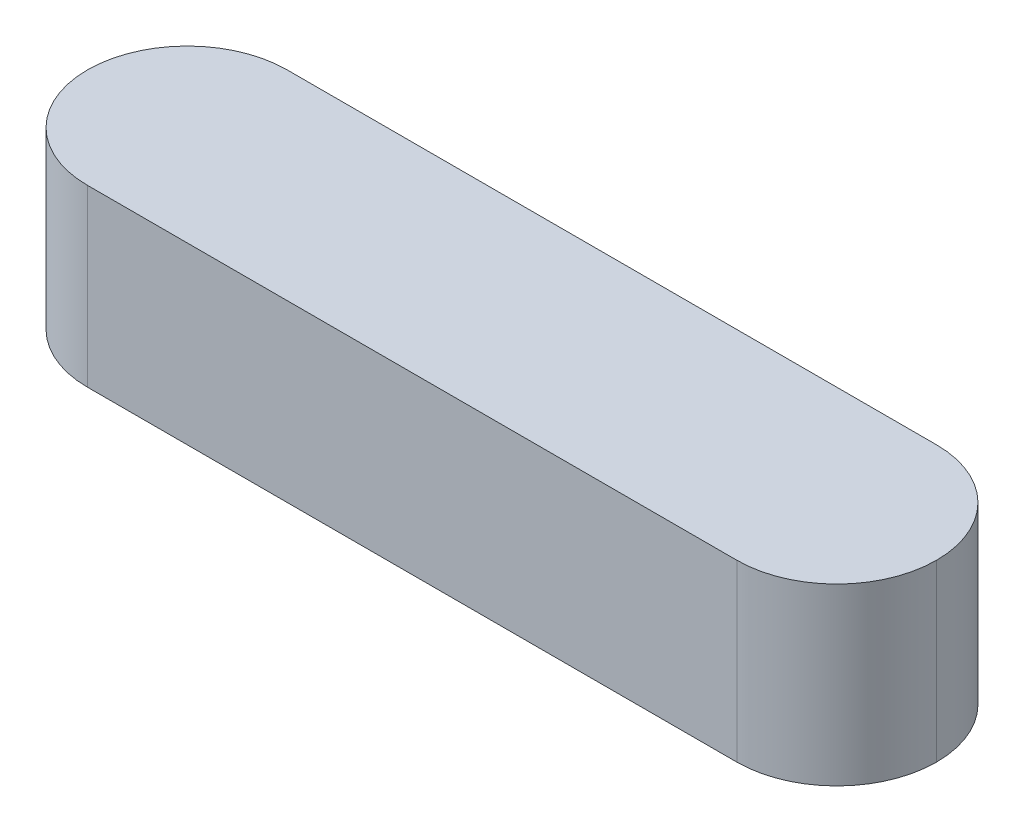
ISO-10303-21;
HEADER;
FILE_DESCRIPTION(('STEP AP214'),'2;1');
FILE_NAME('part.step','',(''),(''),'','','');
FILE_SCHEMA(('AUTOMOTIVE_DESIGN { 1 0 10303 214 1 1 1 1 }'));
ENDSEC;
DATA;
#1=APPLICATION_CONTEXT('core data for automotive mechanical design processes');
#2=APPLICATION_PROTOCOL_DEFINITION('international standard','automotive_design',2000,#1);
#3=PRODUCT_CONTEXT('',#1,'mechanical');
#4=PRODUCT('Part','Part','',(#3));
#5=PRODUCT_RELATED_PRODUCT_CATEGORY('part','',(#4));
#6=PRODUCT_DEFINITION_FORMATION('','',#4);
#7=PRODUCT_DEFINITION_CONTEXT('part definition',#1,'design');
#8=PRODUCT_DEFINITION('design','',#6,#7);
#9=PRODUCT_DEFINITION_SHAPE('','',#8);
#10=(LENGTH_UNIT() NAMED_UNIT(*) SI_UNIT(.MILLI.,.METRE.));
#11=(NAMED_UNIT(*) PLANE_ANGLE_UNIT() SI_UNIT($,.RADIAN.));
#12=(NAMED_UNIT(*) SI_UNIT($,.STERADIAN.) SOLID_ANGLE_UNIT());
#13=UNCERTAINTY_MEASURE_WITH_UNIT(LENGTH_MEASURE(1.E-05),#10,'distance_accuracy_value','');
#14=(GEOMETRIC_REPRESENTATION_CONTEXT(3) GLOBAL_UNCERTAINTY_ASSIGNED_CONTEXT((#13)) GLOBAL_UNIT_ASSIGNED_CONTEXT((#10,
#11,#12)) REPRESENTATION_CONTEXT('',''));
#15=CARTESIAN_POINT('',(0.,0.,0.));
#16=DIRECTION('',(0.,0.,1.));
#17=DIRECTION('',(1.,0.,0.));
#18=AXIS2_PLACEMENT_3D('',#15,#16,#17);
#19=CARTESIAN_POINT('',(-9.90979350945183,7.,0.));
#20=DIRECTION('',(0.,0.,-1.));
#21=DIRECTION('',(-1.,0.,0.));
#22=AXIS2_PLACEMENT_3D('',#19,#20,#21);
#23=PLANE('',#22);
#24=DIRECTION('',(1.,0.,0.));
#25=VECTOR('',#24,1.);
#26=CARTESIAN_POINT('',(-9.90979350945183,0.,0.));
#27=LINE('',#26,#25);
#28=CARTESIAN_POINT('',(-5.90979350945183,0.,0.));
#29=VERTEX_POINT('',#28);
#30=CARTESIAN_POINT('',(20.0902064905482,0.,0.));
#31=VERTEX_POINT('',#30);
#32=EDGE_CURVE('E132',#29,#31,#27,.T.);
#33=ORIENTED_EDGE('',*,*,#32,.T.);
#34=DIRECTION('',(0.,-1.,0.));
#35=VECTOR('',#34,1.);
#36=CARTESIAN_POINT('',(20.0902064905482,7.,0.));
#37=LINE('',#36,#35);
#38=CARTESIAN_POINT('',(20.0902064905482,7.,0.));
#39=VERTEX_POINT('',#38);
#40=EDGE_CURVE('E11',#31,#39,#37,.F.);
#41=ORIENTED_EDGE('',*,*,#40,.T.);
#42=DIRECTION('',(1.,0.,0.));
#43=VECTOR('',#42,1.);
#44=CARTESIAN_POINT('',(-9.90979350945183,7.,0.));
#45=LINE('',#44,#43);
#46=CARTESIAN_POINT('',(-5.90979350945183,7.,0.));
#47=VERTEX_POINT('',#46);
#48=EDGE_CURVE('E131',#47,#39,#45,.T.);
#49=ORIENTED_EDGE('',*,*,#48,.F.);
#50=DIRECTION('',(0.,-1.,0.));
#51=VECTOR('',#50,1.);
#52=CARTESIAN_POINT('',(-5.90979350945183,7.,0.));
#53=LINE('',#52,#51);
#54=EDGE_CURVE('E55',#47,#29,#53,.T.);
#55=ORIENTED_EDGE('',*,*,#54,.T.);
#56=EDGE_LOOP('',(#33,#41,#49,#55));
#57=FACE_BOUND('',#56,.T.);
#58=ADVANCED_FACE('F45',(#57),#23,.F.);
#59=CARTESIAN_POINT('',(-9.90979350945183,7.,-8.));
#60=DIRECTION('',(0.,0.,1.));
#61=DIRECTION('',(1.,0.,0.));
#62=AXIS2_PLACEMENT_3D('',#59,#60,#61);
#63=PLANE('',#62);
#64=DIRECTION('',(-1.,0.,0.));
#65=VECTOR('',#64,1.);
#66=CARTESIAN_POINT('',(-9.90979350945183,7.,-8.));
#67=LINE('',#66,#65);
#68=CARTESIAN_POINT('',(20.0902064905482,7.,-8.));
#69=VERTEX_POINT('',#68);
#70=CARTESIAN_POINT('',(-5.90979350945183,7.,-8.));
#71=VERTEX_POINT('',#70);
#72=EDGE_CURVE('E122',#69,#71,#67,.T.);
#73=ORIENTED_EDGE('',*,*,#72,.F.);
#74=DIRECTION('',(0.,-1.,0.));
#75=VECTOR('',#74,1.);
#76=CARTESIAN_POINT('',(20.0902064905482,7.,-8.));
#77=LINE('',#76,#75);
#78=CARTESIAN_POINT('',(20.0902064905482,0.,-8.));
#79=VERTEX_POINT('',#78);
#80=EDGE_CURVE('E105',#69,#79,#77,.T.);
#81=ORIENTED_EDGE('',*,*,#80,.T.);
#82=DIRECTION('',(-1.,0.,0.));
#83=VECTOR('',#82,1.);
#84=CARTESIAN_POINT('',(-9.90979350945183,0.,-8.));
#85=LINE('',#84,#83);
#86=CARTESIAN_POINT('',(-5.90979350945183,0.,-8.));
#87=VERTEX_POINT('',#86);
#88=EDGE_CURVE('E119',#79,#87,#85,.T.);
#89=ORIENTED_EDGE('',*,*,#88,.T.);
#90=DIRECTION('',(0.,-1.,0.));
#91=VECTOR('',#90,1.);
#92=CARTESIAN_POINT('',(-5.90979350945183,7.,-8.));
#93=LINE('',#92,#91);
#94=EDGE_CURVE('E125',#87,#71,#93,.F.);
#95=ORIENTED_EDGE('',*,*,#94,.T.);
#96=EDGE_LOOP('',(#73,#81,#89,#95));
#97=FACE_BOUND('',#96,.T.);
#98=ADVANCED_FACE('F117',(#97),#63,.F.);
#99=CARTESIAN_POINT('',(0.,7.,0.));
#100=DIRECTION('',(0.,1.,0.));
#101=DIRECTION('',(0.,0.,1.));
#102=AXIS2_PLACEMENT_3D('',#99,#100,#101);
#103=PLANE('',#102);
#104=CARTESIAN_POINT('',(20.0902064905482,7.,-4.));
#105=DIRECTION('',(0.,1.,0.));
#106=DIRECTION('',(0.,0.,1.));
#107=AXIS2_PLACEMENT_3D('',#104,#105,#106);
#108=CIRCLE('',#107,4.);
#109=CARTESIAN_POINT('',(24.0902064905482,7.,-4.));
#110=VERTEX_POINT('',#109);
#111=EDGE_CURVE('E63',#39,#110,#108,.T.);
#112=ORIENTED_EDGE('',*,*,#111,.T.);
#113=CARTESIAN_POINT('',(20.0902064905482,7.,-4.));
#114=DIRECTION('',(0.,1.,0.));
#115=DIRECTION('',(0.,0.,1.));
#116=AXIS2_PLACEMENT_3D('',#113,#114,#115);
#117=CIRCLE('',#116,4.);
#118=EDGE_CURVE('E155',#110,#69,#117,.T.);
#119=ORIENTED_EDGE('',*,*,#118,.T.);
#120=ORIENTED_EDGE('',*,*,#72,.T.);
#121=CARTESIAN_POINT('',(-5.90979350945183,7.,-4.));
#122=DIRECTION('',(0.,1.,0.));
#123=DIRECTION('',(0.,0.,1.));
#124=AXIS2_PLACEMENT_3D('',#121,#122,#123);
#125=CIRCLE('',#124,4.);
#126=CARTESIAN_POINT('',(-9.90979350945183,7.,-4.));
#127=VERTEX_POINT('',#126);
#128=EDGE_CURVE('E150',#71,#127,#125,.T.);
#129=ORIENTED_EDGE('',*,*,#128,.T.);
#130=CARTESIAN_POINT('',(-5.90979350945183,7.,-4.));
#131=DIRECTION('',(0.,1.,0.));
#132=DIRECTION('',(0.,0.,1.));
#133=AXIS2_PLACEMENT_3D('',#130,#131,#132);
#134=CIRCLE('',#133,4.);
#135=EDGE_CURVE('E111',#127,#47,#134,.T.);
#136=ORIENTED_EDGE('',*,*,#135,.T.);
#137=ORIENTED_EDGE('',*,*,#48,.T.);
#138=EDGE_LOOP('',(#112,#119,#120,#129,#136,#137));
#139=FACE_BOUND('',#138,.T.);
#140=ADVANCED_FACE('F169',(#139),#103,.T.);
#141=CARTESIAN_POINT('',(0.,0.,0.));
#142=DIRECTION('',(0.,1.,0.));
#143=DIRECTION('',(0.,0.,1.));
#144=AXIS2_PLACEMENT_3D('',#141,#142,#143);
#145=PLANE('',#144);
#146=ORIENTED_EDGE('',*,*,#88,.F.);
#147=CARTESIAN_POINT('',(20.0902064905482,0.,-4.));
#148=DIRECTION('',(0.,1.,0.));
#149=DIRECTION('',(0.,0.,1.));
#150=AXIS2_PLACEMENT_3D('',#147,#148,#149);
#151=CIRCLE('',#150,4.);
#152=CARTESIAN_POINT('',(24.0902064905482,0.,-4.));
#153=VERTEX_POINT('',#152);
#154=EDGE_CURVE('E101',#79,#153,#151,.F.);
#155=ORIENTED_EDGE('',*,*,#154,.T.);
#156=CARTESIAN_POINT('',(20.0902064905482,0.,-4.));
#157=DIRECTION('',(0.,1.,0.));
#158=DIRECTION('',(0.,0.,1.));
#159=AXIS2_PLACEMENT_3D('',#156,#157,#158);
#160=CIRCLE('',#159,4.);
#161=EDGE_CURVE('E112',#153,#31,#160,.F.);
#162=ORIENTED_EDGE('',*,*,#161,.T.);
#163=ORIENTED_EDGE('',*,*,#32,.F.);
#164=CARTESIAN_POINT('',(-5.90979350945183,0.,-4.));
#165=DIRECTION('',(0.,1.,0.));
#166=DIRECTION('',(0.,0.,1.));
#167=AXIS2_PLACEMENT_3D('',#164,#165,#166);
#168=CIRCLE('',#167,4.);
#169=CARTESIAN_POINT('',(-9.90979350945183,0.,-4.));
#170=VERTEX_POINT('',#169);
#171=EDGE_CURVE('E124',#29,#170,#168,.F.);
#172=ORIENTED_EDGE('',*,*,#171,.T.);
#173=CARTESIAN_POINT('',(-5.90979350945183,0.,-4.));
#174=DIRECTION('',(0.,1.,0.));
#175=DIRECTION('',(0.,0.,1.));
#176=AXIS2_PLACEMENT_3D('',#173,#174,#175);
#177=CIRCLE('',#176,4.);
#178=EDGE_CURVE('E129',#170,#87,#177,.F.);
#179=ORIENTED_EDGE('',*,*,#178,.T.);
#180=EDGE_LOOP('',(#146,#155,#162,#163,#172,#179));
#181=FACE_BOUND('',#180,.T.);
#182=ADVANCED_FACE('F127',(#181),#145,.F.);
#183=CARTESIAN_POINT('',(20.0902064905482,7.,-4.));
#184=DIRECTION('',(0.,-1.,0.));
#185=DIRECTION('',(0.,0.,-1.));
#186=AXIS2_PLACEMENT_3D('',#183,#184,#185);
#187=CYLINDRICAL_SURFACE('',#186,4.);
#188=DIRECTION('',(0.,-1.,0.));
#189=VECTOR('',#188,1.);
#190=CARTESIAN_POINT('',(24.0902064905482,7.,-4.));
#191=LINE('',#190,#189);
#192=EDGE_CURVE('E106',#110,#153,#191,.T.);
#193=ORIENTED_EDGE('',*,*,#192,.F.);
#194=ORIENTED_EDGE('',*,*,#111,.F.);
#195=ORIENTED_EDGE('',*,*,#40,.F.);
#196=ORIENTED_EDGE('',*,*,#161,.F.);
#197=EDGE_LOOP('',(#193,#194,#195,#196));
#198=FACE_BOUND('',#197,.T.);
#199=ADVANCED_FACE('F172',(#198),#187,.T.);
#200=CARTESIAN_POINT('',(20.0902064905482,7.,-4.));
#201=DIRECTION('',(0.,-1.,0.));
#202=DIRECTION('',(0.,0.,-1.));
#203=AXIS2_PLACEMENT_3D('',#200,#201,#202);
#204=CYLINDRICAL_SURFACE('',#203,4.);
#205=ORIENTED_EDGE('',*,*,#118,.F.);
#206=ORIENTED_EDGE('',*,*,#192,.T.);
#207=ORIENTED_EDGE('',*,*,#154,.F.);
#208=ORIENTED_EDGE('',*,*,#80,.F.);
#209=EDGE_LOOP('',(#205,#206,#207,#208));
#210=FACE_BOUND('',#209,.T.);
#211=ADVANCED_FACE('F104',(#210),#204,.T.);
#212=CARTESIAN_POINT('',(-5.90979350945183,7.,-4.));
#213=DIRECTION('',(0.,-1.,0.));
#214=DIRECTION('',(0.,0.,-1.));
#215=AXIS2_PLACEMENT_3D('',#212,#213,#214);
#216=CYLINDRICAL_SURFACE('',#215,4.);
#217=ORIENTED_EDGE('',*,*,#54,.F.);
#218=ORIENTED_EDGE('',*,*,#135,.F.);
#219=DIRECTION('',(0.,-1.,0.));
#220=VECTOR('',#219,1.);
#221=CARTESIAN_POINT('',(-9.90979350945183,7.,-4.));
#222=LINE('',#221,#220);
#223=EDGE_CURVE('E49',#170,#127,#222,.F.);
#224=ORIENTED_EDGE('',*,*,#223,.F.);
#225=ORIENTED_EDGE('',*,*,#171,.F.);
#226=EDGE_LOOP('',(#217,#218,#224,#225));
#227=FACE_BOUND('',#226,.T.);
#228=ADVANCED_FACE('F47',(#227),#216,.T.);
#229=CARTESIAN_POINT('',(-5.90979350945183,7.,-4.));
#230=DIRECTION('',(0.,-1.,0.));
#231=DIRECTION('',(0.,0.,-1.));
#232=AXIS2_PLACEMENT_3D('',#229,#230,#231);
#233=CYLINDRICAL_SURFACE('',#232,4.);
#234=ORIENTED_EDGE('',*,*,#128,.F.);
#235=ORIENTED_EDGE('',*,*,#94,.F.);
#236=ORIENTED_EDGE('',*,*,#178,.F.);
#237=ORIENTED_EDGE('',*,*,#223,.T.);
#238=EDGE_LOOP('',(#234,#235,#236,#237));
#239=FACE_BOUND('',#238,.T.);
#240=ADVANCED_FACE('F164',(#239),#233,.T.);
#241=CLOSED_SHELL('',(#58,#98,#140,#182,#199,#211,#228,#240));
#242=MANIFOLD_SOLID_BREP('B2',#241);
#243=ADVANCED_BREP_SHAPE_REPRESENTATION('',(#18,#242),#14);
#244=SHAPE_DEFINITION_REPRESENTATION(#9,#243);
ENDSEC;
END-ISO-10303-21;
